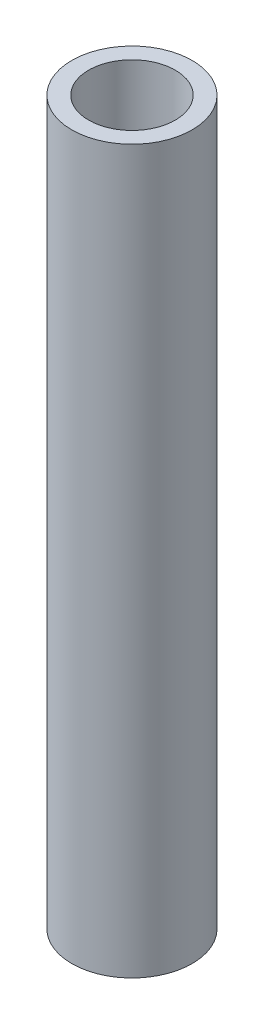
ISO-10303-21;
HEADER;
FILE_DESCRIPTION(('STEP AP214'),'2;1');
FILE_NAME('part.step','',(''),(''),'','','');
FILE_SCHEMA(('AUTOMOTIVE_DESIGN { 1 0 10303 214 1 1 1 1 }'));
ENDSEC;
DATA;
#1=APPLICATION_CONTEXT('core data for automotive mechanical design processes');
#2=APPLICATION_PROTOCOL_DEFINITION('international standard','automotive_design',2000,#1);
#3=PRODUCT_CONTEXT('',#1,'mechanical');
#4=PRODUCT('Part','Part','',(#3));
#5=PRODUCT_RELATED_PRODUCT_CATEGORY('part','',(#4));
#6=PRODUCT_DEFINITION_FORMATION('','',#4);
#7=PRODUCT_DEFINITION_CONTEXT('part definition',#1,'design');
#8=PRODUCT_DEFINITION('design','',#6,#7);
#9=PRODUCT_DEFINITION_SHAPE('','',#8);
#10=(LENGTH_UNIT() NAMED_UNIT(*) SI_UNIT(.MILLI.,.METRE.));
#11=(NAMED_UNIT(*) PLANE_ANGLE_UNIT() SI_UNIT($,.RADIAN.));
#12=(NAMED_UNIT(*) SI_UNIT($,.STERADIAN.) SOLID_ANGLE_UNIT());
#13=UNCERTAINTY_MEASURE_WITH_UNIT(LENGTH_MEASURE(1.E-05),#10,'distance_accuracy_value','');
#14=(GEOMETRIC_REPRESENTATION_CONTEXT(3) GLOBAL_UNCERTAINTY_ASSIGNED_CONTEXT((#13)) GLOBAL_UNIT_ASSIGNED_CONTEXT((#10,
#11,#12)) REPRESENTATION_CONTEXT('',''));
#15=CARTESIAN_POINT('',(0.,0.,0.));
#16=DIRECTION('',(0.,0.,1.));
#17=DIRECTION('',(1.,0.,0.));
#18=AXIS2_PLACEMENT_3D('',#15,#16,#17);
#19=CARTESIAN_POINT('',(0.,38.1,0.));
#20=DIRECTION('',(0.,1.,0.));
#21=DIRECTION('',(0.,0.,1.));
#22=AXIS2_PLACEMENT_3D('',#19,#20,#21);
#23=PLANE('',#22);
#24=CARTESIAN_POINT('',(0.,38.1,0.));
#25=DIRECTION('',(0.,1.,0.));
#26=DIRECTION('',(0.,0.,1.));
#27=AXIS2_PLACEMENT_3D('',#24,#25,#26);
#28=CIRCLE('',#27,3.175);
#29=CARTESIAN_POINT('',(0.,38.1,3.175));
#30=VERTEX_POINT('',#29);
#31=EDGE_CURVE('E10',#30,#30,#28,.T.);
#32=ORIENTED_EDGE('',*,*,#31,.T.);
#33=EDGE_LOOP('',(#32));
#34=FACE_BOUND('',#33,.T.);
#35=CARTESIAN_POINT('',(0.,38.1,0.));
#36=DIRECTION('',(0.,1.,0.));
#37=DIRECTION('',(0.,0.,1.));
#38=AXIS2_PLACEMENT_3D('',#35,#36,#37);
#39=CIRCLE('',#38,2.286);
#40=CARTESIAN_POINT('',(0.,38.1,2.286));
#41=VERTEX_POINT('',#40);
#42=EDGE_CURVE('E41',#41,#41,#39,.T.);
#43=ORIENTED_EDGE('',*,*,#42,.F.);
#44=EDGE_LOOP('',(#43));
#45=FACE_BOUND('',#44,.T.);
#46=ADVANCED_FACE('F30',(#34,#45),#23,.T.);
#47=CARTESIAN_POINT('',(0.,0.,0.));
#48=DIRECTION('',(0.,1.,0.));
#49=DIRECTION('',(0.,0.,1.));
#50=AXIS2_PLACEMENT_3D('',#47,#48,#49);
#51=PLANE('',#50);
#52=CARTESIAN_POINT('',(0.,0.,0.));
#53=DIRECTION('',(0.,1.,0.));
#54=DIRECTION('',(0.,0.,1.));
#55=AXIS2_PLACEMENT_3D('',#52,#53,#54);
#56=CIRCLE('',#55,3.175);
#57=CARTESIAN_POINT('',(0.,0.,3.175));
#58=VERTEX_POINT('',#57);
#59=EDGE_CURVE('E34',#58,#58,#56,.T.);
#60=ORIENTED_EDGE('',*,*,#59,.F.);
#61=EDGE_LOOP('',(#60));
#62=FACE_BOUND('',#61,.T.);
#63=CARTESIAN_POINT('',(0.,0.,0.));
#64=DIRECTION('',(0.,1.,0.));
#65=DIRECTION('',(0.,0.,1.));
#66=AXIS2_PLACEMENT_3D('',#63,#64,#65);
#67=CIRCLE('',#66,2.286);
#68=CARTESIAN_POINT('',(0.,0.,2.286));
#69=VERTEX_POINT('',#68);
#70=EDGE_CURVE('E43',#69,#69,#67,.T.);
#71=ORIENTED_EDGE('',*,*,#70,.T.);
#72=EDGE_LOOP('',(#71));
#73=FACE_BOUND('',#72,.T.);
#74=ADVANCED_FACE('F53',(#62,#73),#51,.F.);
#75=CARTESIAN_POINT('',(0.,38.1,0.));
#76=DIRECTION('',(0.,-1.,0.));
#77=DIRECTION('',(0.,0.,-1.));
#78=AXIS2_PLACEMENT_3D('',#75,#76,#77);
#79=CYLINDRICAL_SURFACE('',#78,3.175);
#80=ORIENTED_EDGE('',*,*,#31,.F.);
#81=EDGE_LOOP('',(#80));
#82=FACE_BOUND('',#81,.T.);
#83=ORIENTED_EDGE('',*,*,#59,.T.);
#84=EDGE_LOOP('',(#83));
#85=FACE_BOUND('',#84,.T.);
#86=ADVANCED_FACE('F32',(#82,#85),#79,.T.);
#87=CARTESIAN_POINT('',(0.,38.1,0.));
#88=DIRECTION('',(0.,-1.,0.));
#89=DIRECTION('',(0.,0.,-1.));
#90=AXIS2_PLACEMENT_3D('',#87,#88,#89);
#91=CYLINDRICAL_SURFACE('',#90,2.286);
#92=ORIENTED_EDGE('',*,*,#42,.T.);
#93=EDGE_LOOP('',(#92));
#94=FACE_BOUND('',#93,.T.);
#95=ORIENTED_EDGE('',*,*,#70,.F.);
#96=EDGE_LOOP('',(#95));
#97=FACE_BOUND('',#96,.T.);
#98=ADVANCED_FACE('F49',(#94,#97),#91,.F.);
#99=CLOSED_SHELL('',(#46,#74,#86,#98));
#100=MANIFOLD_SOLID_BREP('B2',#99);
#101=ADVANCED_BREP_SHAPE_REPRESENTATION('',(#18,#100),#14);
#102=SHAPE_DEFINITION_REPRESENTATION(#9,#101);
ENDSEC;
END-ISO-10303-21;
